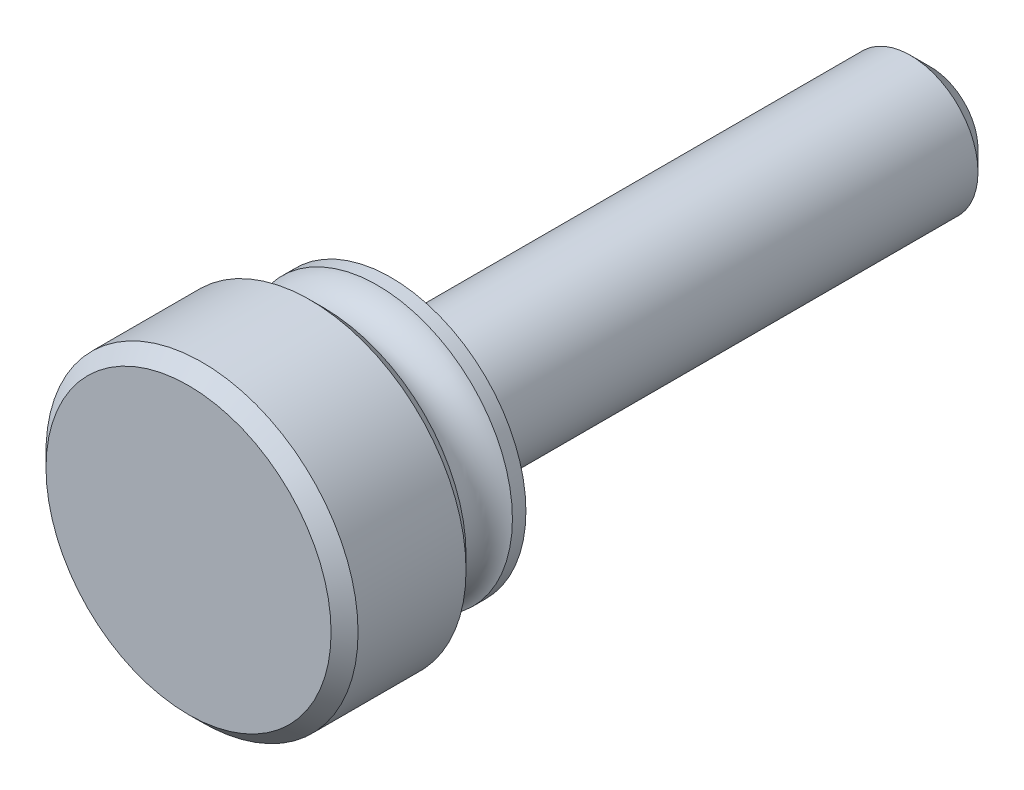
ISO-10303-21;
HEADER;
FILE_DESCRIPTION(('STEP AP214'),'2;1');
FILE_NAME('part.step','',(''),(''),'','','');
FILE_SCHEMA(('AUTOMOTIVE_DESIGN { 1 0 10303 214 1 1 1 1 }'));
ENDSEC;
DATA;
#1=APPLICATION_CONTEXT('core data for automotive mechanical design processes');
#2=APPLICATION_PROTOCOL_DEFINITION('international standard','automotive_design',2000,#1);
#3=PRODUCT_CONTEXT('',#1,'mechanical');
#4=PRODUCT('Part','Part','',(#3));
#5=PRODUCT_RELATED_PRODUCT_CATEGORY('part','',(#4));
#6=PRODUCT_DEFINITION_FORMATION('','',#4);
#7=PRODUCT_DEFINITION_CONTEXT('part definition',#1,'design');
#8=PRODUCT_DEFINITION('design','',#6,#7);
#9=PRODUCT_DEFINITION_SHAPE('','',#8);
#10=(LENGTH_UNIT() NAMED_UNIT(*) SI_UNIT(.MILLI.,.METRE.));
#11=(NAMED_UNIT(*) PLANE_ANGLE_UNIT() SI_UNIT($,.RADIAN.));
#12=(NAMED_UNIT(*) SI_UNIT($,.STERADIAN.) SOLID_ANGLE_UNIT());
#13=UNCERTAINTY_MEASURE_WITH_UNIT(LENGTH_MEASURE(1.E-05),#10,'distance_accuracy_value','');
#14=(GEOMETRIC_REPRESENTATION_CONTEXT(3) GLOBAL_UNCERTAINTY_ASSIGNED_CONTEXT((#13)) GLOBAL_UNIT_ASSIGNED_CONTEXT((#10,
#11,#12)) REPRESENTATION_CONTEXT('',''));
#15=CARTESIAN_POINT('',(0.,0.,0.));
#16=DIRECTION('',(0.,0.,1.));
#17=DIRECTION('',(1.,0.,0.));
#18=AXIS2_PLACEMENT_3D('',#15,#16,#17);
#19=CARTESIAN_POINT('',(0.,0.,3.175));
#20=DIRECTION('',(0.,0.,-1.));
#21=DIRECTION('',(-1.,0.,0.));
#22=AXIS2_PLACEMENT_3D('',#19,#20,#21);
#23=CYLINDRICAL_SURFACE('',#22,6.35);
#24=CARTESIAN_POINT('',(0.,0.,0.));
#25=DIRECTION('',(0.,0.,1.));
#26=DIRECTION('',(1.,0.,0.));
#27=AXIS2_PLACEMENT_3D('',#24,#25,#26);
#28=CIRCLE('',#27,6.35);
#29=CARTESIAN_POINT('',(6.35,0.,0.));
#30=VERTEX_POINT('',#29);
#31=EDGE_CURVE('E63',#30,#30,#28,.T.);
#32=ORIENTED_EDGE('',*,*,#31,.T.);
#33=EDGE_LOOP('',(#32));
#34=FACE_BOUND('',#33,.T.);
#35=CARTESIAN_POINT('',(0.,0.,0.635));
#36=DIRECTION('',(0.,0.,1.));
#37=DIRECTION('',(1.,0.,0.));
#38=AXIS2_PLACEMENT_3D('',#35,#36,#37);
#39=CIRCLE('',#38,6.35);
#40=CARTESIAN_POINT('',(6.35,0.,0.635));
#41=VERTEX_POINT('',#40);
#42=EDGE_CURVE('E66',#41,#41,#39,.T.);
#43=ORIENTED_EDGE('',*,*,#42,.F.);
#44=EDGE_LOOP('',(#43));
#45=FACE_BOUND('',#44,.T.);
#46=ADVANCED_FACE('F34',(#34,#45),#23,.T.);
#47=CARTESIAN_POINT('',(0.,0.,-25.4));
#48=DIRECTION('',(0.,0.,1.));
#49=DIRECTION('',(1.,0.,0.));
#50=AXIS2_PLACEMENT_3D('',#47,#48,#49);
#51=CYLINDRICAL_SURFACE('',#50,3.175);
#52=CARTESIAN_POINT('',(0.,0.,-24.4475));
#53=DIRECTION('',(0.,0.,1.));
#54=DIRECTION('',(1.,0.,0.));
#55=AXIS2_PLACEMENT_3D('',#52,#53,#54);
#56=CIRCLE('',#55,3.175);
#57=CARTESIAN_POINT('',(3.175,0.,-24.4475));
#58=VERTEX_POINT('',#57);
#59=EDGE_CURVE('E57',#58,#58,#56,.T.);
#60=ORIENTED_EDGE('',*,*,#59,.T.);
#61=EDGE_LOOP('',(#60));
#62=FACE_BOUND('',#61,.T.);
#63=CARTESIAN_POINT('',(0.,0.,0.));
#64=DIRECTION('',(0.,0.,1.));
#65=DIRECTION('',(1.,0.,0.));
#66=AXIS2_PLACEMENT_3D('',#63,#64,#65);
#67=CIRCLE('',#66,3.175);
#68=CARTESIAN_POINT('',(3.175,0.,0.));
#69=VERTEX_POINT('',#68);
#70=EDGE_CURVE('E60',#69,#69,#67,.T.);
#71=ORIENTED_EDGE('',*,*,#70,.F.);
#72=EDGE_LOOP('',(#71));
#73=FACE_BOUND('',#72,.T.);
#74=ADVANCED_FACE('F91',(#62,#73),#51,.T.);
#75=CARTESIAN_POINT('',(0.,0.,-25.4));
#76=DIRECTION('',(0.,0.,1.));
#77=DIRECTION('',(1.,0.,0.));
#78=AXIS2_PLACEMENT_3D('',#75,#76,#77);
#79=PLANE('',#78);
#80=CARTESIAN_POINT('',(0.,0.,-25.4));
#81=DIRECTION('',(0.,0.,1.));
#82=DIRECTION('',(1.,0.,0.));
#83=AXIS2_PLACEMENT_3D('',#80,#81,#82);
#84=CIRCLE('',#83,2.22249999999999);
#85=CARTESIAN_POINT('',(2.22249999999999,0.,-25.4));
#86=VERTEX_POINT('',#85);
#87=EDGE_CURVE('E54',#86,#86,#84,.F.);
#88=ORIENTED_EDGE('',*,*,#87,.T.);
#89=EDGE_LOOP('',(#88));
#90=FACE_BOUND('',#89,.T.);
#91=ADVANCED_FACE('F97',(#90),#79,.F.);
#92=CARTESIAN_POINT('',(0.,0.,-24.4475));
#93=DIRECTION('',(0.,0.,1.));
#94=DIRECTION('',(1.,0.,0.));
#95=AXIS2_PLACEMENT_3D('',#92,#93,#94);
#96=CONICAL_SURFACE('',#95,3.175,0.785398163397452);
#97=ORIENTED_EDGE('',*,*,#87,.F.);
#98=EDGE_LOOP('',(#97));
#99=FACE_BOUND('',#98,.T.);
#100=ORIENTED_EDGE('',*,*,#59,.F.);
#101=EDGE_LOOP('',(#100));
#102=FACE_BOUND('',#101,.T.);
#103=ADVANCED_FACE('F87',(#99,#102),#96,.T.);
#104=CARTESIAN_POINT('',(0.,0.,0.));
#105=DIRECTION('',(0.,0.,1.));
#106=DIRECTION('',(1.,0.,0.));
#107=AXIS2_PLACEMENT_3D('',#104,#105,#106);
#108=PLANE('',#107);
#109=ORIENTED_EDGE('',*,*,#70,.T.);
#110=EDGE_LOOP('',(#109));
#111=FACE_BOUND('',#110,.T.);
#112=ORIENTED_EDGE('',*,*,#31,.F.);
#113=EDGE_LOOP('',(#112));
#114=FACE_BOUND('',#113,.T.);
#115=ADVANCED_FACE('F78',(#111,#114),#108,.F.);
#116=CARTESIAN_POINT('',(0.,0.,1.905));
#117=DIRECTION('',(0.,0.,1.));
#118=DIRECTION('',(1.,0.,0.));
#119=AXIS2_PLACEMENT_3D('',#116,#117,#118);
#120=TOROIDAL_SURFACE('',#119,6.82625,1.35636059456916);
#121=ORIENTED_EDGE('',*,*,#42,.T.);
#122=EDGE_LOOP('',(#121));
#123=FACE_BOUND('',#122,.T.);
#124=CARTESIAN_POINT('',(0.,0.,3.175));
#125=DIRECTION('',(0.,0.,1.));
#126=DIRECTION('',(1.,0.,0.));
#127=AXIS2_PLACEMENT_3D('',#124,#125,#126);
#128=CIRCLE('',#127,6.35);
#129=CARTESIAN_POINT('',(6.35,0.,3.175));
#130=VERTEX_POINT('',#129);
#131=EDGE_CURVE('E69',#130,#130,#128,.T.);
#132=ORIENTED_EDGE('',*,*,#131,.F.);
#133=EDGE_LOOP('',(#132));
#134=FACE_BOUND('',#133,.T.);
#135=ADVANCED_FACE('F75',(#123,#134),#120,.F.);
#136=CARTESIAN_POINT('',(0.,0.,9.525));
#137=DIRECTION('',(0.,0.,1.));
#138=DIRECTION('',(1.,0.,0.));
#139=AXIS2_PLACEMENT_3D('',#136,#137,#138);
#140=PLANE('',#139);
#141=CARTESIAN_POINT('',(0.,0.,9.525));
#142=DIRECTION('',(0.,0.,1.));
#143=DIRECTION('',(1.,0.,0.));
#144=AXIS2_PLACEMENT_3D('',#141,#142,#143);
#145=CIRCLE('',#144,6.70718749999999);
#146=CARTESIAN_POINT('',(6.70718749999999,0.,9.525));
#147=VERTEX_POINT('',#146);
#148=EDGE_CURVE('E10',#147,#147,#145,.T.);
#149=ORIENTED_EDGE('',*,*,#148,.T.);
#150=EDGE_LOOP('',(#149));
#151=FACE_BOUND('',#150,.T.);
#152=ADVANCED_FACE('F77',(#151),#140,.T.);
#153=CARTESIAN_POINT('',(0.,0.,9.525));
#154=DIRECTION('',(0.,0.,-1.));
#155=DIRECTION('',(-1.,0.,0.));
#156=AXIS2_PLACEMENT_3D('',#153,#154,#155);
#157=CYLINDRICAL_SURFACE('',#156,7.3421875);
#158=CARTESIAN_POINT('',(0.,0.,3.81));
#159=DIRECTION('',(0.,0.,1.));
#160=DIRECTION('',(1.,0.,0.));
#161=AXIS2_PLACEMENT_3D('',#158,#159,#160);
#162=CIRCLE('',#161,7.3421875);
#163=CARTESIAN_POINT('',(7.3421875,0.,3.81));
#164=VERTEX_POINT('',#163);
#165=EDGE_CURVE('E45',#164,#164,#162,.T.);
#166=ORIENTED_EDGE('',*,*,#165,.T.);
#167=EDGE_LOOP('',(#166));
#168=FACE_BOUND('',#167,.T.);
#169=CARTESIAN_POINT('',(0.,0.,8.88999999999999));
#170=DIRECTION('',(0.,0.,1.));
#171=DIRECTION('',(1.,0.,0.));
#172=AXIS2_PLACEMENT_3D('',#169,#170,#171);
#173=CIRCLE('',#172,7.3421875);
#174=CARTESIAN_POINT('',(7.3421875,0.,8.88999999999999));
#175=VERTEX_POINT('',#174);
#176=EDGE_CURVE('E49',#175,#175,#173,.F.);
#177=ORIENTED_EDGE('',*,*,#176,.T.);
#178=EDGE_LOOP('',(#177));
#179=FACE_BOUND('',#178,.T.);
#180=ADVANCED_FACE('F85',(#168,#179),#157,.T.);
#181=CARTESIAN_POINT('',(0.,0.,3.175));
#182=DIRECTION('',(0.,0.,1.));
#183=DIRECTION('',(1.,0.,0.));
#184=AXIS2_PLACEMENT_3D('',#181,#182,#183);
#185=PLANE('',#184);
#186=CARTESIAN_POINT('',(0.,0.,3.175));
#187=DIRECTION('',(0.,0.,1.));
#188=DIRECTION('',(1.,0.,0.));
#189=AXIS2_PLACEMENT_3D('',#186,#187,#188);
#190=CIRCLE('',#189,6.7071875);
#191=CARTESIAN_POINT('',(6.7071875,0.,3.175));
#192=VERTEX_POINT('',#191);
#193=EDGE_CURVE('E41',#192,#192,#190,.F.);
#194=ORIENTED_EDGE('',*,*,#193,.T.);
#195=EDGE_LOOP('',(#194));
#196=FACE_BOUND('',#195,.T.);
#197=ORIENTED_EDGE('',*,*,#131,.T.);
#198=EDGE_LOOP('',(#197));
#199=FACE_BOUND('',#198,.T.);
#200=ADVANCED_FACE('F73',(#196,#199),#185,.F.);
#201=CARTESIAN_POINT('',(0.,0.,3.81));
#202=DIRECTION('',(0.,0.,1.));
#203=DIRECTION('',(1.,0.,0.));
#204=AXIS2_PLACEMENT_3D('',#201,#202,#203);
#205=CONICAL_SURFACE('',#204,7.3421875,0.785398163397449);
#206=ORIENTED_EDGE('',*,*,#193,.F.);
#207=EDGE_LOOP('',(#206));
#208=FACE_BOUND('',#207,.T.);
#209=ORIENTED_EDGE('',*,*,#165,.F.);
#210=EDGE_LOOP('',(#209));
#211=FACE_BOUND('',#210,.T.);
#212=ADVANCED_FACE('F108',(#208,#211),#205,.T.);
#213=CARTESIAN_POINT('',(0.,0.,9.525));
#214=DIRECTION('',(0.,0.,-1.));
#215=DIRECTION('',(-1.,0.,0.));
#216=AXIS2_PLACEMENT_3D('',#213,#214,#215);
#217=CONICAL_SURFACE('',#216,6.70718749999999,0.785398163397449);
#218=ORIENTED_EDGE('',*,*,#176,.F.);
#219=EDGE_LOOP('',(#218));
#220=FACE_BOUND('',#219,.T.);
#221=ORIENTED_EDGE('',*,*,#148,.F.);
#222=EDGE_LOOP('',(#221));
#223=FACE_BOUND('',#222,.T.);
#224=ADVANCED_FACE('F36',(#220,#223),#217,.T.);
#225=CLOSED_SHELL('',(#46,#74,#91,#103,#115,#135,#152,#180,#200,#212,#224));
#226=MANIFOLD_SOLID_BREP('B2',#225);
#227=ADVANCED_BREP_SHAPE_REPRESENTATION('',(#18,#226),#14);
#228=SHAPE_DEFINITION_REPRESENTATION(#9,#227);
ENDSEC;
END-ISO-10303-21;
